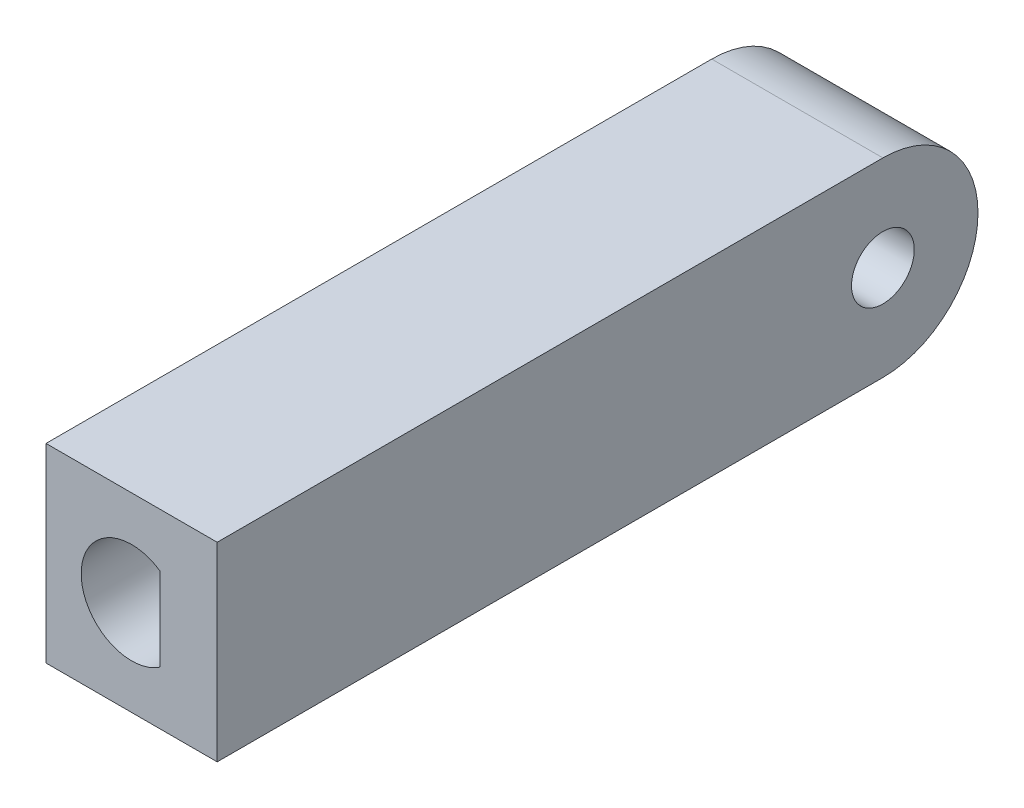
ISO-10303-21;
HEADER;
FILE_DESCRIPTION(('STEP AP214'),'2;1');
FILE_NAME('part.step','',(''),(''),'','','');
FILE_SCHEMA(('AUTOMOTIVE_DESIGN { 1 0 10303 214 1 1 1 1 }'));
ENDSEC;
DATA;
#1=APPLICATION_CONTEXT('core data for automotive mechanical design processes');
#2=APPLICATION_PROTOCOL_DEFINITION('international standard','automotive_design',2000,#1);
#3=PRODUCT_CONTEXT('',#1,'mechanical');
#4=PRODUCT('Part','Part','',(#3));
#5=PRODUCT_RELATED_PRODUCT_CATEGORY('part','',(#4));
#6=PRODUCT_DEFINITION_FORMATION('','',#4);
#7=PRODUCT_DEFINITION_CONTEXT('part definition',#1,'design');
#8=PRODUCT_DEFINITION('design','',#6,#7);
#9=PRODUCT_DEFINITION_SHAPE('','',#8);
#10=(LENGTH_UNIT() NAMED_UNIT(*) SI_UNIT(.MILLI.,.METRE.));
#11=(NAMED_UNIT(*) PLANE_ANGLE_UNIT() SI_UNIT($,.RADIAN.));
#12=(NAMED_UNIT(*) SI_UNIT($,.STERADIAN.) SOLID_ANGLE_UNIT());
#13=UNCERTAINTY_MEASURE_WITH_UNIT(LENGTH_MEASURE(1.E-05),#10,'distance_accuracy_value','');
#14=(GEOMETRIC_REPRESENTATION_CONTEXT(3) GLOBAL_UNCERTAINTY_ASSIGNED_CONTEXT((#13)) GLOBAL_UNIT_ASSIGNED_CONTEXT((#10,
#11,#12)) REPRESENTATION_CONTEXT('',''));
#15=CARTESIAN_POINT('',(0.,0.,0.));
#16=DIRECTION('',(0.,0.,1.));
#17=DIRECTION('',(1.,0.,0.));
#18=AXIS2_PLACEMENT_3D('',#15,#16,#17);
#19=CARTESIAN_POINT('',(0.,0.,40.));
#20=DIRECTION('',(0.,0.,-1.));
#21=DIRECTION('',(-1.,0.,0.));
#22=AXIS2_PLACEMENT_3D('',#19,#20,#21);
#23=PLANE('',#22);
#24=DIRECTION('',(0.,-1.,0.));
#25=VECTOR('',#24,1.);
#26=CARTESIAN_POINT('',(0.,0.,40.));
#27=LINE('',#26,#25);
#28=CARTESIAN_POINT('',(0.,10.,40.));
#29=VERTEX_POINT('',#28);
#30=CARTESIAN_POINT('',(0.,0.,40.));
#31=VERTEX_POINT('',#30);
#32=EDGE_CURVE('E116',#29,#31,#27,.T.);
#33=ORIENTED_EDGE('',*,*,#32,.T.);
#34=DIRECTION('',(1.,0.,0.));
#35=VECTOR('',#34,1.);
#36=CARTESIAN_POINT('',(0.,0.,40.));
#37=LINE('',#36,#35);
#38=CARTESIAN_POINT('',(9.,0.,40.));
#39=VERTEX_POINT('',#38);
#40=EDGE_CURVE('E122',#31,#39,#37,.T.);
#41=ORIENTED_EDGE('',*,*,#40,.T.);
#42=DIRECTION('',(0.,1.,0.));
#43=VECTOR('',#42,1.);
#44=CARTESIAN_POINT('',(9.,0.,40.));
#45=LINE('',#44,#43);
#46=CARTESIAN_POINT('',(9.,10.,40.));
#47=VERTEX_POINT('',#46);
#48=EDGE_CURVE('E124',#39,#47,#45,.T.);
#49=ORIENTED_EDGE('',*,*,#48,.T.);
#50=DIRECTION('',(-1.,0.,0.));
#51=VECTOR('',#50,1.);
#52=CARTESIAN_POINT('',(0.,10.,40.));
#53=LINE('',#52,#51);
#54=EDGE_CURVE('E126',#47,#29,#53,.T.);
#55=ORIENTED_EDGE('',*,*,#54,.T.);
#56=EDGE_LOOP('',(#33,#41,#49,#55));
#57=FACE_BOUND('',#56,.T.);
#58=DIRECTION('',(0.,-1.,0.));
#59=VECTOR('',#58,1.);
#60=CARTESIAN_POINT('',(6.,0.,40.));
#61=LINE('',#60,#59);
#62=CARTESIAN_POINT('',(6.,7.18460522749535,40.));
#63=VERTEX_POINT('',#62);
#64=CARTESIAN_POINT('',(6.,2.81539477250465,40.));
#65=VERTEX_POINT('',#64);
#66=EDGE_CURVE('E49',#63,#65,#61,.T.);
#67=ORIENTED_EDGE('',*,*,#66,.T.);
#68=CARTESIAN_POINT('',(4.5,5.,40.));
#69=DIRECTION('',(0.,0.,1.));
#70=DIRECTION('',(1.,0.,0.));
#71=AXIS2_PLACEMENT_3D('',#68,#69,#70);
#72=CIRCLE('',#71,2.65);
#73=EDGE_CURVE('E105',#63,#65,#72,.T.);
#74=ORIENTED_EDGE('',*,*,#73,.F.);
#75=EDGE_LOOP('',(#67,#74));
#76=FACE_BOUND('',#75,.T.);
#77=ADVANCED_FACE('F33',(#57,#76),#23,.F.);
#78=CARTESIAN_POINT('',(0.,0.,40.));
#79=DIRECTION('',(1.,0.,0.));
#80=DIRECTION('',(0.,0.,-1.));
#81=AXIS2_PLACEMENT_3D('',#78,#79,#80);
#82=PLANE('',#81);
#83=CARTESIAN_POINT('',(0.,5.,5.));
#84=DIRECTION('',(-1.,0.,0.));
#85=DIRECTION('',(0.,0.,1.));
#86=AXIS2_PLACEMENT_3D('',#83,#84,#85);
#87=CIRCLE('',#86,1.65);
#88=CARTESIAN_POINT('',(0.,5.,6.65));
#89=VERTEX_POINT('',#88);
#90=EDGE_CURVE('E117',#89,#89,#87,.T.);
#91=ORIENTED_EDGE('',*,*,#90,.F.);
#92=EDGE_LOOP('',(#91));
#93=FACE_BOUND('',#92,.T.);
#94=CARTESIAN_POINT('',(0.,5.,5.));
#95=DIRECTION('',(1.,0.,0.));
#96=DIRECTION('',(0.,0.,-1.));
#97=AXIS2_PLACEMENT_3D('',#94,#95,#96);
#98=CIRCLE('',#97,5.);
#99=CARTESIAN_POINT('',(0.,10.,5.));
#100=VERTEX_POINT('',#99);
#101=CARTESIAN_POINT('',(0.,5.,0.));
#102=VERTEX_POINT('',#101);
#103=EDGE_CURVE('E145',#100,#102,#98,.F.);
#104=ORIENTED_EDGE('',*,*,#103,.T.);
#105=CARTESIAN_POINT('',(0.,5.,5.));
#106=DIRECTION('',(1.,0.,0.));
#107=DIRECTION('',(0.,0.,-1.));
#108=AXIS2_PLACEMENT_3D('',#105,#106,#107);
#109=CIRCLE('',#108,5.);
#110=CARTESIAN_POINT('',(0.,0.,5.));
#111=VERTEX_POINT('',#110);
#112=EDGE_CURVE('E42',#102,#111,#109,.F.);
#113=ORIENTED_EDGE('',*,*,#112,.T.);
#114=DIRECTION('',(0.,0.,-1.));
#115=VECTOR('',#114,1.);
#116=CARTESIAN_POINT('',(0.,0.,40.));
#117=LINE('',#116,#115);
#118=EDGE_CURVE('E135',#31,#111,#117,.T.);
#119=ORIENTED_EDGE('',*,*,#118,.F.);
#120=ORIENTED_EDGE('',*,*,#32,.F.);
#121=DIRECTION('',(0.,0.,-1.));
#122=VECTOR('',#121,1.);
#123=CARTESIAN_POINT('',(0.,10.,40.));
#124=LINE('',#123,#122);
#125=EDGE_CURVE('E128',#29,#100,#124,.T.);
#126=ORIENTED_EDGE('',*,*,#125,.T.);
#127=EDGE_LOOP('',(#104,#113,#119,#120,#126));
#128=FACE_BOUND('',#127,.T.);
#129=ADVANCED_FACE('F150',(#93,#128),#82,.F.);
#130=CARTESIAN_POINT('',(0.,0.,40.));
#131=DIRECTION('',(0.,1.,0.));
#132=DIRECTION('',(0.,0.,1.));
#133=AXIS2_PLACEMENT_3D('',#130,#131,#132);
#134=PLANE('',#133);
#135=ORIENTED_EDGE('',*,*,#118,.T.);
#136=DIRECTION('',(1.,0.,0.));
#137=VECTOR('',#136,1.);
#138=CARTESIAN_POINT('',(9.,0.,5.));
#139=LINE('',#138,#137);
#140=CARTESIAN_POINT('',(9.,0.,5.));
#141=VERTEX_POINT('',#140);
#142=EDGE_CURVE('E138',#111,#141,#139,.T.);
#143=ORIENTED_EDGE('',*,*,#142,.T.);
#144=DIRECTION('',(0.,0.,-1.));
#145=VECTOR('',#144,1.);
#146=CARTESIAN_POINT('',(9.,0.,40.));
#147=LINE('',#146,#145);
#148=EDGE_CURVE('E132',#39,#141,#147,.T.);
#149=ORIENTED_EDGE('',*,*,#148,.F.);
#150=ORIENTED_EDGE('',*,*,#40,.F.);
#151=EDGE_LOOP('',(#135,#143,#149,#150));
#152=FACE_BOUND('',#151,.T.);
#153=ADVANCED_FACE('F158',(#152),#134,.F.);
#154=CARTESIAN_POINT('',(9.,0.,40.));
#155=DIRECTION('',(-1.,0.,0.));
#156=DIRECTION('',(0.,0.,1.));
#157=AXIS2_PLACEMENT_3D('',#154,#155,#156);
#158=PLANE('',#157);
#159=CARTESIAN_POINT('',(9.,5.,5.));
#160=DIRECTION('',(-1.,0.,0.));
#161=DIRECTION('',(0.,0.,1.));
#162=AXIS2_PLACEMENT_3D('',#159,#160,#161);
#163=CIRCLE('',#162,1.65);
#164=CARTESIAN_POINT('',(9.,5.,6.65));
#165=VERTEX_POINT('',#164);
#166=EDGE_CURVE('E113',#165,#165,#163,.T.);
#167=ORIENTED_EDGE('',*,*,#166,.T.);
#168=EDGE_LOOP('',(#167));
#169=FACE_BOUND('',#168,.T.);
#170=ORIENTED_EDGE('',*,*,#148,.T.);
#171=CARTESIAN_POINT('',(9.,5.,5.));
#172=DIRECTION('',(-1.,0.,0.));
#173=DIRECTION('',(0.,0.,1.));
#174=AXIS2_PLACEMENT_3D('',#171,#172,#173);
#175=CIRCLE('',#174,5.);
#176=CARTESIAN_POINT('',(9.,5.,0.));
#177=VERTEX_POINT('',#176);
#178=EDGE_CURVE('E143',#141,#177,#175,.F.);
#179=ORIENTED_EDGE('',*,*,#178,.T.);
#180=CARTESIAN_POINT('',(9.,5.,5.));
#181=DIRECTION('',(-1.,0.,0.));
#182=DIRECTION('',(0.,0.,1.));
#183=AXIS2_PLACEMENT_3D('',#180,#181,#182);
#184=CIRCLE('',#183,5.);
#185=CARTESIAN_POINT('',(9.,10.,5.));
#186=VERTEX_POINT('',#185);
#187=EDGE_CURVE('E141',#177,#186,#184,.F.);
#188=ORIENTED_EDGE('',*,*,#187,.T.);
#189=DIRECTION('',(0.,0.,-1.));
#190=VECTOR('',#189,1.);
#191=CARTESIAN_POINT('',(9.,10.,40.));
#192=LINE('',#191,#190);
#193=EDGE_CURVE('E130',#47,#186,#192,.T.);
#194=ORIENTED_EDGE('',*,*,#193,.F.);
#195=ORIENTED_EDGE('',*,*,#48,.F.);
#196=EDGE_LOOP('',(#170,#179,#188,#194,#195));
#197=FACE_BOUND('',#196,.T.);
#198=ADVANCED_FACE('F163',(#169,#197),#158,.F.);
#199=CARTESIAN_POINT('',(0.,10.,40.));
#200=DIRECTION('',(0.,-1.,0.));
#201=DIRECTION('',(0.,0.,-1.));
#202=AXIS2_PLACEMENT_3D('',#199,#200,#201);
#203=PLANE('',#202);
#204=ORIENTED_EDGE('',*,*,#193,.T.);
#205=DIRECTION('',(-1.,0.,0.));
#206=VECTOR('',#205,1.);
#207=CARTESIAN_POINT('',(0.,10.,5.));
#208=LINE('',#207,#206);
#209=EDGE_CURVE('E11',#186,#100,#208,.T.);
#210=ORIENTED_EDGE('',*,*,#209,.T.);
#211=ORIENTED_EDGE('',*,*,#125,.F.);
#212=ORIENTED_EDGE('',*,*,#54,.F.);
#213=EDGE_LOOP('',(#204,#210,#211,#212));
#214=FACE_BOUND('',#213,.T.);
#215=ADVANCED_FACE('F173',(#214),#203,.F.);
#216=CARTESIAN_POINT('',(9.,5.,5.));
#217=DIRECTION('',(-1.,0.,0.));
#218=DIRECTION('',(0.,0.,1.));
#219=AXIS2_PLACEMENT_3D('',#216,#217,#218);
#220=CYLINDRICAL_SURFACE('',#219,1.65);
#221=ORIENTED_EDGE('',*,*,#166,.F.);
#222=EDGE_LOOP('',(#221));
#223=FACE_BOUND('',#222,.T.);
#224=ORIENTED_EDGE('',*,*,#90,.T.);
#225=EDGE_LOOP('',(#224));
#226=FACE_BOUND('',#225,.T.);
#227=ADVANCED_FACE('F168',(#223,#226),#220,.F.);
#228=CARTESIAN_POINT('',(0.,5.,5.));
#229=DIRECTION('',(1.,0.,0.));
#230=DIRECTION('',(0.,0.,-1.));
#231=AXIS2_PLACEMENT_3D('',#228,#229,#230);
#232=CYLINDRICAL_SURFACE('',#231,5.);
#233=DIRECTION('',(-1.,0.,0.));
#234=VECTOR('',#233,1.);
#235=CARTESIAN_POINT('',(9.,5.,0.));
#236=LINE('',#235,#234);
#237=EDGE_CURVE('E37',#102,#177,#236,.F.);
#238=ORIENTED_EDGE('',*,*,#237,.F.);
#239=ORIENTED_EDGE('',*,*,#103,.F.);
#240=ORIENTED_EDGE('',*,*,#209,.F.);
#241=ORIENTED_EDGE('',*,*,#187,.F.);
#242=EDGE_LOOP('',(#238,#239,#240,#241));
#243=FACE_BOUND('',#242,.T.);
#244=ADVANCED_FACE('F35',(#243),#232,.T.);
#245=CARTESIAN_POINT('',(0.,5.,5.));
#246=DIRECTION('',(-1.,0.,0.));
#247=DIRECTION('',(0.,0.,1.));
#248=AXIS2_PLACEMENT_3D('',#245,#246,#247);
#249=CYLINDRICAL_SURFACE('',#248,5.);
#250=ORIENTED_EDGE('',*,*,#112,.F.);
#251=ORIENTED_EDGE('',*,*,#237,.T.);
#252=ORIENTED_EDGE('',*,*,#178,.F.);
#253=ORIENTED_EDGE('',*,*,#142,.F.);
#254=EDGE_LOOP('',(#250,#251,#252,#253));
#255=FACE_BOUND('',#254,.T.);
#256=ADVANCED_FACE('F160',(#255),#249,.T.);
#257=CARTESIAN_POINT('',(6.,0.,30.));
#258=DIRECTION('',(-1.,0.,0.));
#259=DIRECTION('',(0.,-1.,0.));
#260=AXIS2_PLACEMENT_3D('',#257,#258,#259);
#261=PLANE('',#260);
#262=ORIENTED_EDGE('',*,*,#66,.F.);
#263=DIRECTION('',(0.,0.,1.));
#264=VECTOR('',#263,1.);
#265=CARTESIAN_POINT('',(6.,7.18460522749535,30.));
#266=LINE('',#265,#264);
#267=CARTESIAN_POINT('',(6.,7.18460522749535,30.));
#268=VERTEX_POINT('',#267);
#269=EDGE_CURVE('E90',#268,#63,#266,.T.);
#270=ORIENTED_EDGE('',*,*,#269,.F.);
#271=DIRECTION('',(0.,-1.,0.));
#272=VECTOR('',#271,1.);
#273=CARTESIAN_POINT('',(6.,0.,30.));
#274=LINE('',#273,#272);
#275=CARTESIAN_POINT('',(6.,2.81539477250465,30.));
#276=VERTEX_POINT('',#275);
#277=EDGE_CURVE('E93',#268,#276,#274,.T.);
#278=ORIENTED_EDGE('',*,*,#277,.T.);
#279=DIRECTION('',(0.,0.,1.));
#280=VECTOR('',#279,1.);
#281=CARTESIAN_POINT('',(6.,2.81539477250465,30.));
#282=LINE('',#281,#280);
#283=EDGE_CURVE('E99',#276,#65,#282,.T.);
#284=ORIENTED_EDGE('',*,*,#283,.T.);
#285=EDGE_LOOP('',(#262,#270,#278,#284));
#286=FACE_BOUND('',#285,.T.);
#287=ADVANCED_FACE('F92',(#286),#261,.T.);
#288=CARTESIAN_POINT('',(4.5,5.,30.));
#289=DIRECTION('',(0.,0.,1.));
#290=DIRECTION('',(1.,0.,0.));
#291=AXIS2_PLACEMENT_3D('',#288,#289,#290);
#292=CYLINDRICAL_SURFACE('',#291,2.65);
#293=ORIENTED_EDGE('',*,*,#73,.T.);
#294=ORIENTED_EDGE('',*,*,#283,.F.);
#295=CARTESIAN_POINT('',(4.5,5.,30.));
#296=DIRECTION('',(0.,0.,1.));
#297=DIRECTION('',(1.,0.,0.));
#298=AXIS2_PLACEMENT_3D('',#295,#296,#297);
#299=CIRCLE('',#298,2.65);
#300=EDGE_CURVE('E100',#268,#276,#299,.T.);
#301=ORIENTED_EDGE('',*,*,#300,.F.);
#302=ORIENTED_EDGE('',*,*,#269,.T.);
#303=EDGE_LOOP('',(#293,#294,#301,#302));
#304=FACE_BOUND('',#303,.T.);
#305=ADVANCED_FACE('F107',(#304),#292,.F.);
#306=CARTESIAN_POINT('',(0.,0.,30.));
#307=DIRECTION('',(0.,0.,1.));
#308=DIRECTION('',(1.,0.,0.));
#309=AXIS2_PLACEMENT_3D('',#306,#307,#308);
#310=PLANE('',#309);
#311=ORIENTED_EDGE('',*,*,#277,.F.);
#312=ORIENTED_EDGE('',*,*,#300,.T.);
#313=EDGE_LOOP('',(#311,#312));
#314=FACE_BOUND('',#313,.T.);
#315=ADVANCED_FACE('F104',(#314),#310,.T.);
#316=CLOSED_SHELL('',(#77,#129,#153,#198,#215,#227,#244,#256,#287,#305,#315));
#317=MANIFOLD_SOLID_BREP('B2',#316);
#318=ADVANCED_BREP_SHAPE_REPRESENTATION('',(#18,#317),#14);
#319=SHAPE_DEFINITION_REPRESENTATION(#9,#318);
ENDSEC;
END-ISO-10303-21;
